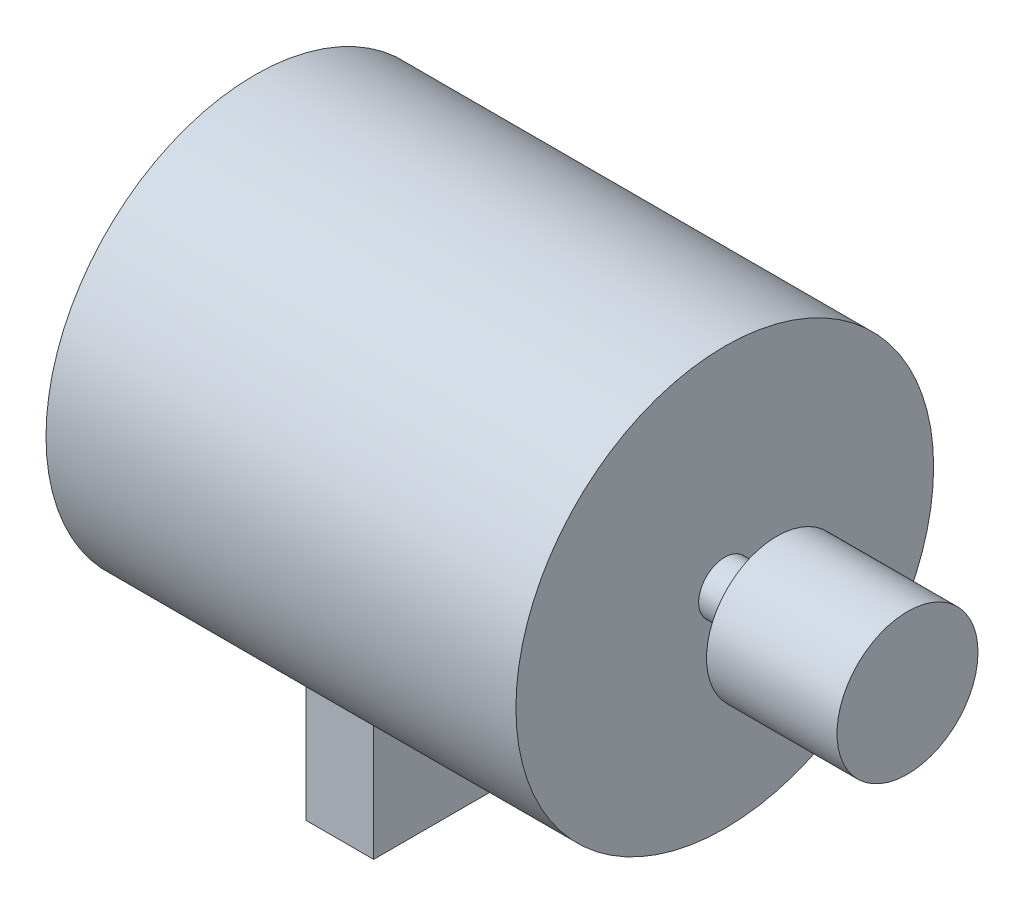
ISO-10303-21;
HEADER;
FILE_DESCRIPTION(('STEP AP214'),'2;1');
FILE_NAME('part.step','',(''),(''),'','','');
FILE_SCHEMA(('AUTOMOTIVE_DESIGN { 1 0 10303 214 1 1 1 1 }'));
ENDSEC;
DATA;
#1=APPLICATION_CONTEXT('core data for automotive mechanical design processes');
#2=APPLICATION_PROTOCOL_DEFINITION('international standard','automotive_design',2000,#1);
#3=PRODUCT_CONTEXT('',#1,'mechanical');
#4=PRODUCT('Part','Part','',(#3));
#5=PRODUCT_RELATED_PRODUCT_CATEGORY('part','',(#4));
#6=PRODUCT_DEFINITION_FORMATION('','',#4);
#7=PRODUCT_DEFINITION_CONTEXT('part definition',#1,'design');
#8=PRODUCT_DEFINITION('design','',#6,#7);
#9=PRODUCT_DEFINITION_SHAPE('','',#8);
#10=(LENGTH_UNIT() NAMED_UNIT(*) SI_UNIT(.MILLI.,.METRE.));
#11=(NAMED_UNIT(*) PLANE_ANGLE_UNIT() SI_UNIT($,.RADIAN.));
#12=(NAMED_UNIT(*) SI_UNIT($,.STERADIAN.) SOLID_ANGLE_UNIT());
#13=UNCERTAINTY_MEASURE_WITH_UNIT(LENGTH_MEASURE(1.E-05),#10,'distance_accuracy_value','');
#14=(GEOMETRIC_REPRESENTATION_CONTEXT(3) GLOBAL_UNCERTAINTY_ASSIGNED_CONTEXT((#13)) GLOBAL_UNIT_ASSIGNED_CONTEXT((#10,
#11,#12)) REPRESENTATION_CONTEXT('',''));
#15=CARTESIAN_POINT('',(0.,0.,0.));
#16=DIRECTION('',(0.,0.,1.));
#17=DIRECTION('',(1.,0.,0.));
#18=AXIS2_PLACEMENT_3D('',#15,#16,#17);
#19=CARTESIAN_POINT('',(8.,4.,0.));
#20=DIRECTION('',(-1.,0.,0.));
#21=DIRECTION('',(0.,0.,1.));
#22=AXIS2_PLACEMENT_3D('',#19,#20,#21);
#23=CYLINDRICAL_SURFACE('',#22,0.5);
#24=CARTESIAN_POINT('',(4.5,4.,0.));
#25=DIRECTION('',(1.,0.,0.));
#26=DIRECTION('',(0.,0.,-1.));
#27=AXIS2_PLACEMENT_3D('',#24,#25,#26);
#28=CIRCLE('',#27,0.5);
#29=CARTESIAN_POINT('',(4.5,4.,-0.5));
#30=VERTEX_POINT('',#29);
#31=EDGE_CURVE('E104',#30,#30,#28,.T.);
#32=ORIENTED_EDGE('',*,*,#31,.T.);
#33=EDGE_LOOP('',(#32));
#34=FACE_BOUND('',#33,.T.);
#35=CARTESIAN_POINT('',(5.5,4.,0.));
#36=DIRECTION('',(1.,0.,0.));
#37=DIRECTION('',(0.,0.,-1.));
#38=AXIS2_PLACEMENT_3D('',#35,#36,#37);
#39=CIRCLE('',#38,0.5);
#40=CARTESIAN_POINT('',(5.5,4.,-0.5));
#41=VERTEX_POINT('',#40);
#42=EDGE_CURVE('E11',#41,#41,#39,.T.);
#43=ORIENTED_EDGE('',*,*,#42,.F.);
#44=EDGE_LOOP('',(#43));
#45=FACE_BOUND('',#44,.T.);
#46=ADVANCED_FACE('F41',(#34,#45),#23,.T.);
#47=CARTESIAN_POINT('',(-4.5,0.,0.));
#48=DIRECTION('',(-1.,0.,0.));
#49=DIRECTION('',(0.,0.,1.));
#50=AXIS2_PLACEMENT_3D('',#47,#48,#49);
#51=PLANE('',#50);
#52=CARTESIAN_POINT('',(-4.5,4.,0.));
#53=DIRECTION('',(-1.,0.,0.));
#54=DIRECTION('',(0.,0.,1.));
#55=AXIS2_PLACEMENT_3D('',#52,#53,#54);
#56=CIRCLE('',#55,4.);
#57=CARTESIAN_POINT('',(-4.5,4.,4.));
#58=VERTEX_POINT('',#57);
#59=EDGE_CURVE('E131',#58,#58,#56,.T.);
#60=ORIENTED_EDGE('',*,*,#59,.T.);
#61=EDGE_LOOP('',(#60));
#62=FACE_BOUND('',#61,.T.);
#63=ADVANCED_FACE('F43',(#62),#51,.T.);
#64=CARTESIAN_POINT('',(4.5,0.,0.));
#65=DIRECTION('',(1.,0.,0.));
#66=DIRECTION('',(0.,0.,-1.));
#67=AXIS2_PLACEMENT_3D('',#64,#65,#66);
#68=PLANE('',#67);
#69=ORIENTED_EDGE('',*,*,#31,.F.);
#70=EDGE_LOOP('',(#69));
#71=FACE_BOUND('',#70,.T.);
#72=CARTESIAN_POINT('',(4.5,4.,0.));
#73=DIRECTION('',(-1.,0.,0.));
#74=DIRECTION('',(0.,0.,1.));
#75=AXIS2_PLACEMENT_3D('',#72,#73,#74);
#76=CIRCLE('',#75,4.);
#77=CARTESIAN_POINT('',(4.5,4.,4.));
#78=VERTEX_POINT('',#77);
#79=EDGE_CURVE('E50',#78,#78,#76,.T.);
#80=ORIENTED_EDGE('',*,*,#79,.F.);
#81=EDGE_LOOP('',(#80));
#82=FACE_BOUND('',#81,.T.);
#83=ADVANCED_FACE('F144',(#71,#82),#68,.T.);
#84=CARTESIAN_POINT('',(-4.5,4.,0.));
#85=DIRECTION('',(-1.,0.,0.));
#86=DIRECTION('',(0.,0.,1.));
#87=AXIS2_PLACEMENT_3D('',#84,#85,#86);
#88=CYLINDRICAL_SURFACE('',#87,4.);
#89=CARTESIAN_POINT('',(0.65,4.,0.));
#90=DIRECTION('',(-1.,0.,0.));
#91=DIRECTION('',(0.,0.,1.));
#92=AXIS2_PLACEMENT_3D('',#89,#90,#91);
#93=CIRCLE('',#92,4.);
#94=CARTESIAN_POINT('',(0.65,1.21892556733913,-2.875));
#95=VERTEX_POINT('',#94);
#96=CARTESIAN_POINT('',(0.65,1.21892556733913,2.875));
#97=VERTEX_POINT('',#96);
#98=EDGE_CURVE('E80',#95,#97,#93,.T.);
#99=ORIENTED_EDGE('',*,*,#98,.F.);
#100=DIRECTION('',(-1.,0.,0.));
#101=VECTOR('',#100,1.);
#102=CARTESIAN_POINT('',(-4.5,1.21892556733913,-2.875));
#103=LINE('',#102,#101);
#104=CARTESIAN_POINT('',(-0.65,1.21892556733913,-2.875));
#105=VERTEX_POINT('',#104);
#106=EDGE_CURVE('E85',#105,#95,#103,.F.);
#107=ORIENTED_EDGE('',*,*,#106,.F.);
#108=CARTESIAN_POINT('',(-0.65,4.,0.));
#109=DIRECTION('',(1.,0.,0.));
#110=DIRECTION('',(0.,0.,-1.));
#111=AXIS2_PLACEMENT_3D('',#108,#109,#110);
#112=CIRCLE('',#111,4.);
#113=CARTESIAN_POINT('',(-0.65,1.21892556733913,2.875));
#114=VERTEX_POINT('',#113);
#115=EDGE_CURVE('E62',#114,#105,#112,.T.);
#116=ORIENTED_EDGE('',*,*,#115,.F.);
#117=DIRECTION('',(-1.,0.,0.));
#118=VECTOR('',#117,1.);
#119=CARTESIAN_POINT('',(-4.5,1.21892556733913,2.875));
#120=LINE('',#119,#118);
#121=EDGE_CURVE('E57',#97,#114,#120,.T.);
#122=ORIENTED_EDGE('',*,*,#121,.F.);
#123=EDGE_LOOP('',(#99,#107,#116,#122));
#124=FACE_BOUND('',#123,.T.);
#125=ORIENTED_EDGE('',*,*,#79,.T.);
#126=EDGE_LOOP('',(#125));
#127=FACE_BOUND('',#126,.T.);
#128=ORIENTED_EDGE('',*,*,#59,.F.);
#129=EDGE_LOOP('',(#128));
#130=FACE_BOUND('',#129,.T.);
#131=ADVANCED_FACE('F82',(#124,#127,#130),#88,.T.);
#132=CARTESIAN_POINT('',(0.65,-1.,2.875));
#133=DIRECTION('',(1.,0.,0.));
#134=DIRECTION('',(0.,0.,-1.));
#135=AXIS2_PLACEMENT_3D('',#132,#133,#134);
#136=PLANE('',#135);
#137=DIRECTION('',(0.,1.,0.));
#138=VECTOR('',#137,1.);
#139=CARTESIAN_POINT('',(0.65,-1.,-2.875));
#140=LINE('',#139,#138);
#141=CARTESIAN_POINT('',(0.65,-1.,-2.875));
#142=VERTEX_POINT('',#141);
#143=EDGE_CURVE('E91',#142,#95,#140,.T.);
#144=ORIENTED_EDGE('',*,*,#143,.T.);
#145=ORIENTED_EDGE('',*,*,#98,.T.);
#146=DIRECTION('',(0.,1.,0.));
#147=VECTOR('',#146,1.);
#148=CARTESIAN_POINT('',(0.65,-1.,2.875));
#149=LINE('',#148,#147);
#150=CARTESIAN_POINT('',(0.65,-1.,2.875));
#151=VERTEX_POINT('',#150);
#152=EDGE_CURVE('E128',#151,#97,#149,.T.);
#153=ORIENTED_EDGE('',*,*,#152,.F.);
#154=DIRECTION('',(0.,0.,-1.));
#155=VECTOR('',#154,1.);
#156=CARTESIAN_POINT('',(0.65,-1.,2.875));
#157=LINE('',#156,#155);
#158=EDGE_CURVE('E94',#151,#142,#157,.T.);
#159=ORIENTED_EDGE('',*,*,#158,.T.);
#160=EDGE_LOOP('',(#144,#145,#153,#159));
#161=FACE_BOUND('',#160,.T.);
#162=ADVANCED_FACE('F92',(#161),#136,.T.);
#163=CARTESIAN_POINT('',(-0.65,-1.,2.875));
#164=DIRECTION('',(0.,0.,1.));
#165=DIRECTION('',(1.,0.,0.));
#166=AXIS2_PLACEMENT_3D('',#163,#164,#165);
#167=PLANE('',#166);
#168=ORIENTED_EDGE('',*,*,#152,.T.);
#169=ORIENTED_EDGE('',*,*,#121,.T.);
#170=DIRECTION('',(0.,1.,0.));
#171=VECTOR('',#170,1.);
#172=CARTESIAN_POINT('',(-0.65,-1.,2.875));
#173=LINE('',#172,#171);
#174=CARTESIAN_POINT('',(-0.65,-1.,2.875));
#175=VERTEX_POINT('',#174);
#176=EDGE_CURVE('E132',#175,#114,#173,.T.);
#177=ORIENTED_EDGE('',*,*,#176,.F.);
#178=DIRECTION('',(1.,0.,0.));
#179=VECTOR('',#178,1.);
#180=CARTESIAN_POINT('',(-0.65,-1.,2.875));
#181=LINE('',#180,#179);
#182=EDGE_CURVE('E100',#175,#151,#181,.T.);
#183=ORIENTED_EDGE('',*,*,#182,.T.);
#184=EDGE_LOOP('',(#168,#169,#177,#183));
#185=FACE_BOUND('',#184,.T.);
#186=ADVANCED_FACE('F169',(#185),#167,.T.);
#187=CARTESIAN_POINT('',(-0.65,-1.,2.875));
#188=DIRECTION('',(-1.,0.,0.));
#189=DIRECTION('',(0.,0.,1.));
#190=AXIS2_PLACEMENT_3D('',#187,#188,#189);
#191=PLANE('',#190);
#192=ORIENTED_EDGE('',*,*,#115,.T.);
#193=DIRECTION('',(0.,1.,0.));
#194=VECTOR('',#193,1.);
#195=CARTESIAN_POINT('',(-0.65,-1.,-2.875));
#196=LINE('',#195,#194);
#197=CARTESIAN_POINT('',(-0.65,-1.,-2.875));
#198=VERTEX_POINT('',#197);
#199=EDGE_CURVE('E99',#198,#105,#196,.T.);
#200=ORIENTED_EDGE('',*,*,#199,.F.);
#201=DIRECTION('',(0.,0.,1.));
#202=VECTOR('',#201,1.);
#203=CARTESIAN_POINT('',(-0.65,-1.,2.875));
#204=LINE('',#203,#202);
#205=EDGE_CURVE('E121',#198,#175,#204,.T.);
#206=ORIENTED_EDGE('',*,*,#205,.T.);
#207=ORIENTED_EDGE('',*,*,#176,.T.);
#208=EDGE_LOOP('',(#192,#200,#206,#207));
#209=FACE_BOUND('',#208,.T.);
#210=ADVANCED_FACE('F172',(#209),#191,.T.);
#211=CARTESIAN_POINT('',(-0.65,-1.,-2.875));
#212=DIRECTION('',(0.,0.,-1.));
#213=DIRECTION('',(-1.,0.,0.));
#214=AXIS2_PLACEMENT_3D('',#211,#212,#213);
#215=PLANE('',#214);
#216=ORIENTED_EDGE('',*,*,#199,.T.);
#217=ORIENTED_EDGE('',*,*,#106,.T.);
#218=ORIENTED_EDGE('',*,*,#143,.F.);
#219=DIRECTION('',(-1.,0.,0.));
#220=VECTOR('',#219,1.);
#221=CARTESIAN_POINT('',(-0.65,-1.,-2.875));
#222=LINE('',#221,#220);
#223=EDGE_CURVE('E118',#142,#198,#222,.T.);
#224=ORIENTED_EDGE('',*,*,#223,.T.);
#225=EDGE_LOOP('',(#216,#217,#218,#224));
#226=FACE_BOUND('',#225,.T.);
#227=ADVANCED_FACE('F102',(#226),#215,.T.);
#228=CARTESIAN_POINT('',(0.,-1.,0.));
#229=DIRECTION('',(0.,-1.,0.));
#230=DIRECTION('',(0.,0.,-1.));
#231=AXIS2_PLACEMENT_3D('',#228,#229,#230);
#232=PLANE('',#231);
#233=ORIENTED_EDGE('',*,*,#158,.F.);
#234=ORIENTED_EDGE('',*,*,#182,.F.);
#235=ORIENTED_EDGE('',*,*,#205,.F.);
#236=ORIENTED_EDGE('',*,*,#223,.F.);
#237=EDGE_LOOP('',(#233,#234,#235,#236));
#238=FACE_BOUND('',#237,.T.);
#239=ADVANCED_FACE('F164',(#238),#232,.T.);
#240=CARTESIAN_POINT('',(5.5,4.,0.));
#241=DIRECTION('',(1.,0.,0.));
#242=DIRECTION('',(0.,0.,-1.));
#243=AXIS2_PLACEMENT_3D('',#240,#241,#242);
#244=CYLINDRICAL_SURFACE('',#243,1.35);
#245=CARTESIAN_POINT('',(5.5,4.,0.));
#246=DIRECTION('',(1.,0.,0.));
#247=DIRECTION('',(0.,0.,-1.));
#248=AXIS2_PLACEMENT_3D('',#245,#246,#247);
#249=CIRCLE('',#248,1.35);
#250=CARTESIAN_POINT('',(5.5,4.,-1.35));
#251=VERTEX_POINT('',#250);
#252=EDGE_CURVE('E108',#251,#251,#249,.T.);
#253=ORIENTED_EDGE('',*,*,#252,.T.);
#254=EDGE_LOOP('',(#253));
#255=FACE_BOUND('',#254,.T.);
#256=CARTESIAN_POINT('',(8.,4.,0.));
#257=DIRECTION('',(1.,0.,0.));
#258=DIRECTION('',(0.,0.,-1.));
#259=AXIS2_PLACEMENT_3D('',#256,#257,#258);
#260=CIRCLE('',#259,1.35);
#261=CARTESIAN_POINT('',(8.,4.,-1.35));
#262=VERTEX_POINT('',#261);
#263=EDGE_CURVE('E263',#262,#262,#260,.T.);
#264=ORIENTED_EDGE('',*,*,#263,.F.);
#265=EDGE_LOOP('',(#264));
#266=FACE_BOUND('',#265,.T.);
#267=ADVANCED_FACE('F167',(#255,#266),#244,.T.);
#268=CARTESIAN_POINT('',(5.5,4.,0.));
#269=DIRECTION('',(1.,0.,0.));
#270=DIRECTION('',(0.,0.,-1.));
#271=AXIS2_PLACEMENT_3D('',#268,#269,#270);
#272=PLANE('',#271);
#273=ORIENTED_EDGE('',*,*,#42,.T.);
#274=EDGE_LOOP('',(#273));
#275=FACE_BOUND('',#274,.T.);
#276=ORIENTED_EDGE('',*,*,#252,.F.);
#277=EDGE_LOOP('',(#276));
#278=FACE_BOUND('',#277,.T.);
#279=ADVANCED_FACE('F206',(#275,#278),#272,.F.);
#280=CARTESIAN_POINT('',(8.,4.,0.));
#281=DIRECTION('',(1.,0.,0.));
#282=DIRECTION('',(0.,0.,-1.));
#283=AXIS2_PLACEMENT_3D('',#280,#281,#282);
#284=PLANE('',#283);
#285=ORIENTED_EDGE('',*,*,#263,.T.);
#286=EDGE_LOOP('',(#285));
#287=FACE_BOUND('',#286,.T.);
#288=ADVANCED_FACE('F162',(#287),#284,.T.);
#289=CLOSED_SHELL('',(#46,#63,#83,#131,#162,#186,#210,#227,#239,#267,#279,#288));
#290=MANIFOLD_SOLID_BREP('B2',#289);
#291=ADVANCED_BREP_SHAPE_REPRESENTATION('',(#18,#290),#14);
#292=SHAPE_DEFINITION_REPRESENTATION(#9,#291);
ENDSEC;
END-ISO-10303-21;
